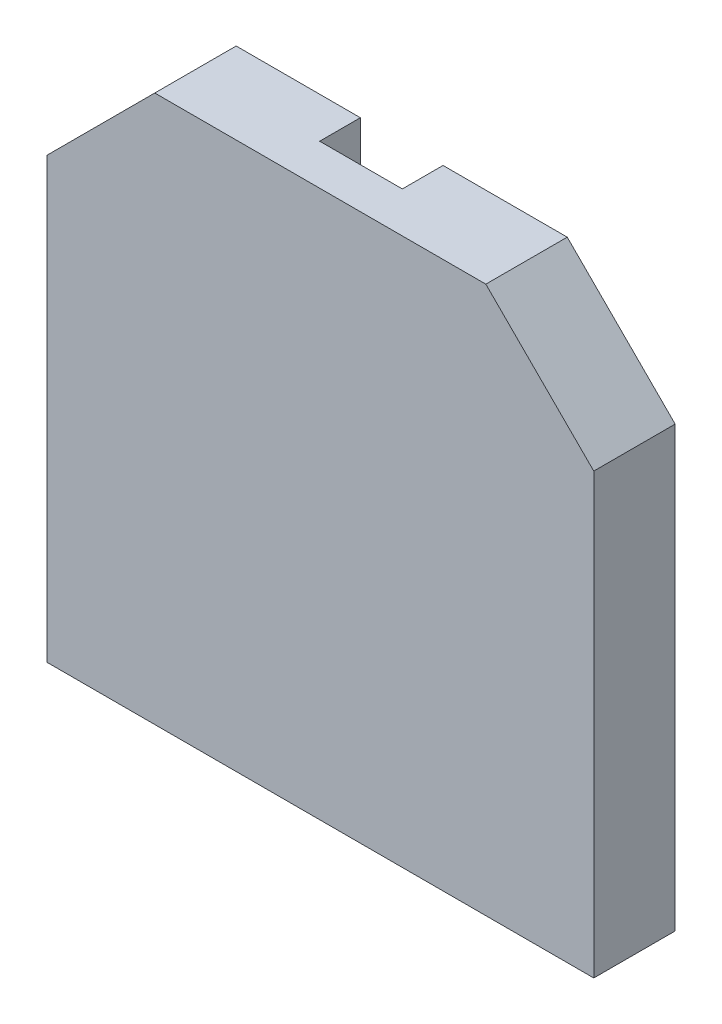
ISO-10303-21;
HEADER;
FILE_DESCRIPTION(('STEP AP214'),'2;1');
FILE_NAME('part.step','',(''),(''),'','','');
FILE_SCHEMA(('AUTOMOTIVE_DESIGN { 1 0 10303 214 1 1 1 1 }'));
ENDSEC;
DATA;
#1=APPLICATION_CONTEXT('core data for automotive mechanical design processes');
#2=APPLICATION_PROTOCOL_DEFINITION('international standard','automotive_design',2000,#1);
#3=PRODUCT_CONTEXT('',#1,'mechanical');
#4=PRODUCT('Part','Part','',(#3));
#5=PRODUCT_RELATED_PRODUCT_CATEGORY('part','',(#4));
#6=PRODUCT_DEFINITION_FORMATION('','',#4);
#7=PRODUCT_DEFINITION_CONTEXT('part definition',#1,'design');
#8=PRODUCT_DEFINITION('design','',#6,#7);
#9=PRODUCT_DEFINITION_SHAPE('','',#8);
#10=(LENGTH_UNIT() NAMED_UNIT(*) SI_UNIT(.MILLI.,.METRE.));
#11=(NAMED_UNIT(*) PLANE_ANGLE_UNIT() SI_UNIT($,.RADIAN.));
#12=(NAMED_UNIT(*) SI_UNIT($,.STERADIAN.) SOLID_ANGLE_UNIT());
#13=UNCERTAINTY_MEASURE_WITH_UNIT(LENGTH_MEASURE(1.E-05),#10,'distance_accuracy_value','');
#14=(GEOMETRIC_REPRESENTATION_CONTEXT(3) GLOBAL_UNCERTAINTY_ASSIGNED_CONTEXT((#13)) GLOBAL_UNIT_ASSIGNED_CONTEXT((#10,
#11,#12)) REPRESENTATION_CONTEXT('',''));
#15=CARTESIAN_POINT('',(0.,0.,0.));
#16=DIRECTION('',(0.,0.,1.));
#17=DIRECTION('',(1.,0.,0.));
#18=AXIS2_PLACEMENT_3D('',#15,#16,#17);
#19=CARTESIAN_POINT('',(-0.32500062,-2.34697524,0.31999936));
#20=DIRECTION('',(0.,0.,-1.));
#21=DIRECTION('',(-1.,0.,0.));
#22=AXIS2_PLACEMENT_3D('',#19,#20,#21);
#23=PLANE('',#22);
#24=DIRECTION('',(0.,1.,0.));
#25=VECTOR('',#24,1.);
#26=CARTESIAN_POINT('',(0.32500062,-4.14280096,0.31999936));
#27=LINE('',#26,#25);
#28=CARTESIAN_POINT('',(0.32500062,-3.9928038,0.31999936));
#29=VERTEX_POINT('',#28);
#30=CARTESIAN_POINT('',(0.32500062,-2.34697524,0.31999936));
#31=VERTEX_POINT('',#30);
#32=EDGE_CURVE('E115',#29,#31,#27,.T.);
#33=ORIENTED_EDGE('',*,*,#32,.F.);
#34=DIRECTION('',(-1.,0.,0.));
#35=VECTOR('',#34,1.);
#36=CARTESIAN_POINT('',(-0.32500062,-3.9928038,0.31999936));
#37=LINE('',#36,#35);
#38=CARTESIAN_POINT('',(-0.32500062,-3.9928038,0.31999936));
#39=VERTEX_POINT('',#38);
#40=EDGE_CURVE('E19',#29,#39,#37,.T.);
#41=ORIENTED_EDGE('',*,*,#40,.T.);
#42=DIRECTION('',(0.,1.,0.));
#43=VECTOR('',#42,1.);
#44=CARTESIAN_POINT('',(-0.32500062,-2.34697524,0.31999936));
#45=LINE('',#44,#43);
#46=CARTESIAN_POINT('',(-0.32500062,-2.34697524,0.31999936));
#47=VERTEX_POINT('',#46);
#48=EDGE_CURVE('E142',#47,#39,#45,.F.);
#49=ORIENTED_EDGE('',*,*,#48,.F.);
#50=DIRECTION('',(1.,0.,0.));
#51=VECTOR('',#50,1.);
#52=CARTESIAN_POINT('',(0.32500062,-2.34697524,0.31999936));
#53=LINE('',#52,#51);
#54=EDGE_CURVE('E131',#31,#47,#53,.F.);
#55=ORIENTED_EDGE('',*,*,#54,.F.);
#56=EDGE_LOOP('',(#33,#41,#49,#55));
#57=FACE_BOUND('',#56,.T.);
#58=ADVANCED_FACE('F16',(#57),#23,.T.);
#59=CARTESIAN_POINT('',(-0.32500062,0.45719746,0.31999936));
#60=DIRECTION('',(0.,0.,-1.));
#61=DIRECTION('',(-1.,0.,0.));
#62=AXIS2_PLACEMENT_3D('',#59,#60,#61);
#63=PLANE('',#62);
#64=DIRECTION('',(0.,1.,0.));
#65=VECTOR('',#64,1.);
#66=CARTESIAN_POINT('',(-0.32500062,0.45719746,0.31999936));
#67=LINE('',#66,#65);
#68=CARTESIAN_POINT('',(-0.32500062,0.30719776,0.31999936));
#69=VERTEX_POINT('',#68);
#70=CARTESIAN_POINT('',(-0.32500062,-1.33862826,0.31999936));
#71=VERTEX_POINT('',#70);
#72=EDGE_CURVE('E145',#69,#71,#67,.F.);
#73=ORIENTED_EDGE('',*,*,#72,.F.);
#74=DIRECTION('',(-1.,0.,0.));
#75=VECTOR('',#74,1.);
#76=CARTESIAN_POINT('',(-0.32500062,0.30719776,0.31999936));
#77=LINE('',#76,#75);
#78=CARTESIAN_POINT('',(0.32500062,0.30719776,0.31999936));
#79=VERTEX_POINT('',#78);
#80=EDGE_CURVE('E127',#69,#79,#77,.F.);
#81=ORIENTED_EDGE('',*,*,#80,.T.);
#82=DIRECTION('',(0.,1.,0.));
#83=VECTOR('',#82,1.);
#84=CARTESIAN_POINT('',(0.32500062,-1.33862826,0.31999936));
#85=LINE('',#84,#83);
#86=CARTESIAN_POINT('',(0.32500062,-1.33862826,0.31999936));
#87=VERTEX_POINT('',#86);
#88=EDGE_CURVE('E158',#87,#79,#85,.T.);
#89=ORIENTED_EDGE('',*,*,#88,.F.);
#90=DIRECTION('',(1.,0.,0.));
#91=VECTOR('',#90,1.);
#92=CARTESIAN_POINT('',(-0.32500062,-1.33862826,0.31999936));
#93=LINE('',#92,#91);
#94=EDGE_CURVE('E150',#71,#87,#93,.T.);
#95=ORIENTED_EDGE('',*,*,#94,.F.);
#96=EDGE_LOOP('',(#73,#81,#89,#95));
#97=FACE_BOUND('',#96,.T.);
#98=ADVANCED_FACE('F264',(#97),#63,.T.);
#99=CARTESIAN_POINT('',(0.32500062,-4.14280096,-1.00000054));
#100=DIRECTION('',(-1.,0.,0.));
#101=DIRECTION('',(0.,0.,1.));
#102=AXIS2_PLACEMENT_3D('',#99,#100,#101);
#103=PLANE('',#102);
#104=DIRECTION('',(0.,1.,0.));
#105=VECTOR('',#104,1.);
#106=CARTESIAN_POINT('',(0.32500062,-0.54133242,0.));
#107=LINE('',#106,#105);
#108=CARTESIAN_POINT('',(0.32500062,-3.9928038,0.));
#109=VERTEX_POINT('',#108);
#110=CARTESIAN_POINT('',(0.32500062,-2.34697524,0.));
#111=VERTEX_POINT('',#110);
#112=EDGE_CURVE('E129',#109,#111,#107,.T.);
#113=ORIENTED_EDGE('',*,*,#112,.F.);
#114=DIRECTION('',(0.,0.,1.));
#115=VECTOR('',#114,1.);
#116=CARTESIAN_POINT('',(0.32500062,-3.9928038,-1.00000054));
#117=LINE('',#116,#115);
#118=EDGE_CURVE('E120',#109,#29,#117,.T.);
#119=ORIENTED_EDGE('',*,*,#118,.T.);
#120=ORIENTED_EDGE('',*,*,#32,.T.);
#121=DIRECTION('',(0.,0.,-1.));
#122=VECTOR('',#121,1.);
#123=CARTESIAN_POINT('',(0.32500062,-2.34697524,-1.00000054));
#124=LINE('',#123,#122);
#125=EDGE_CURVE('E137',#111,#31,#124,.F.);
#126=ORIENTED_EDGE('',*,*,#125,.F.);
#127=EDGE_LOOP('',(#113,#119,#120,#126));
#128=FACE_BOUND('',#127,.T.);
#129=ADVANCED_FACE('F128',(#128),#103,.T.);
#130=CARTESIAN_POINT('',(0.32500062,-2.34697524,-1.00000054));
#131=DIRECTION('',(0.,-1.,0.));
#132=DIRECTION('',(0.,0.,-1.));
#133=AXIS2_PLACEMENT_3D('',#130,#131,#132);
#134=PLANE('',#133);
#135=DIRECTION('',(-1.,0.,0.));
#136=VECTOR('',#135,1.);
#137=CARTESIAN_POINT('',(-2.15000078,-2.34697524,0.));
#138=LINE('',#137,#136);
#139=CARTESIAN_POINT('',(-0.32500062,-2.34697524,0.));
#140=VERTEX_POINT('',#139);
#141=EDGE_CURVE('E164',#111,#140,#138,.T.);
#142=ORIENTED_EDGE('',*,*,#141,.F.);
#143=ORIENTED_EDGE('',*,*,#125,.T.);
#144=ORIENTED_EDGE('',*,*,#54,.T.);
#145=DIRECTION('',(0.,0.,-1.));
#146=VECTOR('',#145,1.);
#147=CARTESIAN_POINT('',(-0.32500062,-2.34697524,-1.00000054));
#148=LINE('',#147,#146);
#149=EDGE_CURVE('E139',#140,#47,#148,.F.);
#150=ORIENTED_EDGE('',*,*,#149,.F.);
#151=EDGE_LOOP('',(#142,#143,#144,#150));
#152=FACE_BOUND('',#151,.T.);
#153=ADVANCED_FACE('F254',(#152),#134,.T.);
#154=CARTESIAN_POINT('',(-0.32500062,-2.34697524,-1.00000054));
#155=DIRECTION('',(1.,0.,0.));
#156=DIRECTION('',(0.,0.,-1.));
#157=AXIS2_PLACEMENT_3D('',#154,#155,#156);
#158=PLANE('',#157);
#159=ORIENTED_EDGE('',*,*,#48,.T.);
#160=DIRECTION('',(0.,0.,-1.));
#161=VECTOR('',#160,1.);
#162=CARTESIAN_POINT('',(-0.32500062,-3.9928038,-1.00000054));
#163=LINE('',#162,#161);
#164=CARTESIAN_POINT('',(-0.32500062,-3.9928038,0.));
#165=VERTEX_POINT('',#164);
#166=EDGE_CURVE('E123',#39,#165,#163,.T.);
#167=ORIENTED_EDGE('',*,*,#166,.T.);
#168=DIRECTION('',(0.,1.,0.));
#169=VECTOR('',#168,1.);
#170=CARTESIAN_POINT('',(-0.32500062,-0.54133242,0.));
#171=LINE('',#170,#169);
#172=EDGE_CURVE('E166',#140,#165,#171,.F.);
#173=ORIENTED_EDGE('',*,*,#172,.F.);
#174=ORIENTED_EDGE('',*,*,#149,.T.);
#175=EDGE_LOOP('',(#159,#167,#173,#174));
#176=FACE_BOUND('',#175,.T.);
#177=ADVANCED_FACE('F252',(#176),#158,.T.);
#178=CARTESIAN_POINT('',(-0.32500062,0.45719746,-1.00000054));
#179=DIRECTION('',(1.,0.,0.));
#180=DIRECTION('',(0.,0.,-1.));
#181=AXIS2_PLACEMENT_3D('',#178,#179,#180);
#182=PLANE('',#181);
#183=DIRECTION('',(0.,1.,0.));
#184=VECTOR('',#183,1.);
#185=CARTESIAN_POINT('',(-0.32500062,-0.54133242,0.));
#186=LINE('',#185,#184);
#187=CARTESIAN_POINT('',(-0.32500062,0.30719776,0.));
#188=VERTEX_POINT('',#187);
#189=CARTESIAN_POINT('',(-0.32500062,-1.33862826,0.));
#190=VERTEX_POINT('',#189);
#191=EDGE_CURVE('E169',#188,#190,#186,.F.);
#192=ORIENTED_EDGE('',*,*,#191,.F.);
#193=DIRECTION('',(0.,0.,-1.));
#194=VECTOR('',#193,1.);
#195=CARTESIAN_POINT('',(-0.32500062,0.30719776,-1.00000054));
#196=LINE('',#195,#194);
#197=EDGE_CURVE('E147',#188,#69,#196,.F.);
#198=ORIENTED_EDGE('',*,*,#197,.T.);
#199=ORIENTED_EDGE('',*,*,#72,.T.);
#200=DIRECTION('',(0.,0.,1.));
#201=VECTOR('',#200,1.);
#202=CARTESIAN_POINT('',(-0.32500062,-1.33862826,-1.00000054));
#203=LINE('',#202,#201);
#204=EDGE_CURVE('E152',#190,#71,#203,.T.);
#205=ORIENTED_EDGE('',*,*,#204,.F.);
#206=EDGE_LOOP('',(#192,#198,#199,#205));
#207=FACE_BOUND('',#206,.T.);
#208=ADVANCED_FACE('F262',(#207),#182,.T.);
#209=CARTESIAN_POINT('',(-0.32500062,-1.33862826,-1.00000054));
#210=DIRECTION('',(0.,1.,0.));
#211=DIRECTION('',(0.,0.,1.));
#212=AXIS2_PLACEMENT_3D('',#209,#210,#211);
#213=PLANE('',#212);
#214=DIRECTION('',(-1.,0.,0.));
#215=VECTOR('',#214,1.);
#216=CARTESIAN_POINT('',(-2.15000078,-1.33862826,0.));
#217=LINE('',#216,#215);
#218=CARTESIAN_POINT('',(0.32500062,-1.33862826,0.));
#219=VERTEX_POINT('',#218);
#220=EDGE_CURVE('E171',#190,#219,#217,.F.);
#221=ORIENTED_EDGE('',*,*,#220,.F.);
#222=ORIENTED_EDGE('',*,*,#204,.T.);
#223=ORIENTED_EDGE('',*,*,#94,.T.);
#224=DIRECTION('',(0.,0.,1.));
#225=VECTOR('',#224,1.);
#226=CARTESIAN_POINT('',(0.32500062,-1.33862826,-1.00000054));
#227=LINE('',#226,#225);
#228=EDGE_CURVE('E155',#219,#87,#227,.T.);
#229=ORIENTED_EDGE('',*,*,#228,.F.);
#230=EDGE_LOOP('',(#221,#222,#223,#229));
#231=FACE_BOUND('',#230,.T.);
#232=ADVANCED_FACE('F288',(#231),#213,.T.);
#233=CARTESIAN_POINT('',(0.32500062,-1.33862826,-1.00000054));
#234=DIRECTION('',(-1.,0.,0.));
#235=DIRECTION('',(0.,0.,1.));
#236=AXIS2_PLACEMENT_3D('',#233,#234,#235);
#237=PLANE('',#236);
#238=ORIENTED_EDGE('',*,*,#88,.T.);
#239=DIRECTION('',(0.,0.,1.));
#240=VECTOR('',#239,1.);
#241=CARTESIAN_POINT('',(0.32500062,0.30719776,-1.00000054));
#242=LINE('',#241,#240);
#243=CARTESIAN_POINT('',(0.32500062,0.30719776,0.));
#244=VERTEX_POINT('',#243);
#245=EDGE_CURVE('E161',#79,#244,#242,.F.);
#246=ORIENTED_EDGE('',*,*,#245,.T.);
#247=DIRECTION('',(0.,1.,0.));
#248=VECTOR('',#247,1.);
#249=CARTESIAN_POINT('',(0.32500062,-0.54133242,0.));
#250=LINE('',#249,#248);
#251=EDGE_CURVE('E173',#219,#244,#250,.T.);
#252=ORIENTED_EDGE('',*,*,#251,.F.);
#253=ORIENTED_EDGE('',*,*,#228,.T.);
#254=EDGE_LOOP('',(#238,#246,#252,#253));
#255=FACE_BOUND('',#254,.T.);
#256=ADVANCED_FACE('F285',(#255),#237,.T.);
#257=CARTESIAN_POINT('',(-2.15000078,-0.54133242,0.));
#258=DIRECTION('',(0.,0.,-1.));
#259=DIRECTION('',(-1.,0.,0.));
#260=AXIS2_PLACEMENT_3D('',#257,#258,#259);
#261=PLANE('',#260);
#262=DIRECTION('',(0.707106781186548,-0.707106781186548,0.));
#263=VECTOR('',#262,1.);
#264=CARTESIAN_POINT('',(2.15000078,-0.54133242,0.));
#265=LINE('',#264,#263);
#266=CARTESIAN_POINT('',(1.3014706,0.30719776,0.));
#267=VERTEX_POINT('',#266);
#268=CARTESIAN_POINT('',(2.15000078,-0.54133242,0.));
#269=VERTEX_POINT('',#268);
#270=EDGE_CURVE('E193',#267,#269,#265,.T.);
#271=ORIENTED_EDGE('',*,*,#270,.T.);
#272=DIRECTION('',(0.,1.,0.));
#273=VECTOR('',#272,1.);
#274=CARTESIAN_POINT('',(2.15000078,-3.9928038,0.));
#275=LINE('',#274,#273);
#276=CARTESIAN_POINT('',(2.15000078,-3.9928038,0.));
#277=VERTEX_POINT('',#276);
#278=EDGE_CURVE('E199',#269,#277,#275,.F.);
#279=ORIENTED_EDGE('',*,*,#278,.T.);
#280=DIRECTION('',(1.,0.,0.));
#281=VECTOR('',#280,1.);
#282=CARTESIAN_POINT('',(-2.15000078,-3.9928038,0.));
#283=LINE('',#282,#281);
#284=EDGE_CURVE('E211',#277,#109,#283,.F.);
#285=ORIENTED_EDGE('',*,*,#284,.T.);
#286=ORIENTED_EDGE('',*,*,#112,.T.);
#287=ORIENTED_EDGE('',*,*,#141,.T.);
#288=ORIENTED_EDGE('',*,*,#172,.T.);
#289=DIRECTION('',(1.,0.,0.));
#290=VECTOR('',#289,1.);
#291=CARTESIAN_POINT('',(-2.15000078,-3.9928038,0.));
#292=LINE('',#291,#290);
#293=CARTESIAN_POINT('',(-2.15000078,-3.9928038,0.));
#294=VERTEX_POINT('',#293);
#295=EDGE_CURVE('E204',#165,#294,#292,.F.);
#296=ORIENTED_EDGE('',*,*,#295,.T.);
#297=DIRECTION('',(0.,1.,0.));
#298=VECTOR('',#297,1.);
#299=CARTESIAN_POINT('',(-2.15000078,-0.54133242,0.));
#300=LINE('',#299,#298);
#301=CARTESIAN_POINT('',(-2.15000078,-0.54133242,0.));
#302=VERTEX_POINT('',#301);
#303=EDGE_CURVE('E176',#294,#302,#300,.T.);
#304=ORIENTED_EDGE('',*,*,#303,.T.);
#305=DIRECTION('',(0.707106781186548,0.707106781186548,0.));
#306=VECTOR('',#305,1.);
#307=CARTESIAN_POINT('',(-1.3014706,0.30719776,0.));
#308=LINE('',#307,#306);
#309=CARTESIAN_POINT('',(-1.3014706,0.30719776,0.));
#310=VERTEX_POINT('',#309);
#311=EDGE_CURVE('E179',#302,#310,#308,.T.);
#312=ORIENTED_EDGE('',*,*,#311,.T.);
#313=DIRECTION('',(1.,0.,0.));
#314=VECTOR('',#313,1.);
#315=CARTESIAN_POINT('',(1.3014706,0.30719776,0.));
#316=LINE('',#315,#314);
#317=EDGE_CURVE('E187',#310,#188,#316,.T.);
#318=ORIENTED_EDGE('',*,*,#317,.T.);
#319=ORIENTED_EDGE('',*,*,#191,.T.);
#320=ORIENTED_EDGE('',*,*,#220,.T.);
#321=ORIENTED_EDGE('',*,*,#251,.T.);
#322=DIRECTION('',(1.,0.,0.));
#323=VECTOR('',#322,1.);
#324=CARTESIAN_POINT('',(1.3014706,0.30719776,0.));
#325=LINE('',#324,#323);
#326=EDGE_CURVE('E190',#244,#267,#325,.T.);
#327=ORIENTED_EDGE('',*,*,#326,.T.);
#328=EDGE_LOOP('',(#271,#279,#285,#286,#287,#288,#296,#304,#312,#318,#319,#320,#321,#327));
#329=FACE_BOUND('',#328,.T.);
#330=ADVANCED_FACE('F247',(#329),#261,.T.);
#331=CARTESIAN_POINT('',(-2.15000078,-0.54133242,0.));
#332=DIRECTION('',(1.,0.,0.));
#333=DIRECTION('',(0.,0.,-1.));
#334=AXIS2_PLACEMENT_3D('',#331,#332,#333);
#335=PLANE('',#334);
#336=DIRECTION('',(0.,1.,0.));
#337=VECTOR('',#336,1.);
#338=CARTESIAN_POINT('',(-2.15000078,-0.54133242,0.64000126));
#339=LINE('',#338,#337);
#340=CARTESIAN_POINT('',(-2.15000078,-3.9928038,0.64000126));
#341=VERTEX_POINT('',#340);
#342=CARTESIAN_POINT('',(-2.15000078,-0.54133242,0.64000126));
#343=VERTEX_POINT('',#342);
#344=EDGE_CURVE('E213',#341,#343,#339,.T.);
#345=ORIENTED_EDGE('',*,*,#344,.T.);
#346=DIRECTION('',(0.,0.,1.));
#347=VECTOR('',#346,1.);
#348=CARTESIAN_POINT('',(-2.15000078,-0.54133242,0.));
#349=LINE('',#348,#347);
#350=EDGE_CURVE('E181',#343,#302,#349,.F.);
#351=ORIENTED_EDGE('',*,*,#350,.T.);
#352=ORIENTED_EDGE('',*,*,#303,.F.);
#353=DIRECTION('',(0.,0.,1.));
#354=VECTOR('',#353,1.);
#355=CARTESIAN_POINT('',(-2.15000078,-3.9928038,0.));
#356=LINE('',#355,#354);
#357=EDGE_CURVE('E207',#294,#341,#356,.T.);
#358=ORIENTED_EDGE('',*,*,#357,.T.);
#359=EDGE_LOOP('',(#345,#351,#352,#358));
#360=FACE_BOUND('',#359,.T.);
#361=ADVANCED_FACE('F244',(#360),#335,.F.);
#362=CARTESIAN_POINT('',(-1.3014706,0.30719776,0.));
#363=DIRECTION('',(0.707106781186548,-0.707106781186548,0.));
#364=DIRECTION('',(0.707106781186548,0.707106781186548,0.));
#365=AXIS2_PLACEMENT_3D('',#362,#363,#364);
#366=PLANE('',#365);
#367=DIRECTION('',(0.707106781186547,0.707106781186548,0.));
#368=VECTOR('',#367,1.);
#369=CARTESIAN_POINT('',(-2.15000078,-0.54133242,0.64000126));
#370=LINE('',#369,#368);
#371=CARTESIAN_POINT('',(-1.3014706,0.30719776,0.64000126));
#372=VERTEX_POINT('',#371);
#373=EDGE_CURVE('E216',#343,#372,#370,.T.);
#374=ORIENTED_EDGE('',*,*,#373,.T.);
#375=DIRECTION('',(0.,0.,-1.));
#376=VECTOR('',#375,1.);
#377=CARTESIAN_POINT('',(-1.3014706,0.30719776,0.));
#378=LINE('',#377,#376);
#379=EDGE_CURVE('E184',#372,#310,#378,.T.);
#380=ORIENTED_EDGE('',*,*,#379,.T.);
#381=ORIENTED_EDGE('',*,*,#311,.F.);
#382=ORIENTED_EDGE('',*,*,#350,.F.);
#383=EDGE_LOOP('',(#374,#380,#381,#382));
#384=FACE_BOUND('',#383,.T.);
#385=ADVANCED_FACE('F242',(#384),#366,.F.);
#386=CARTESIAN_POINT('',(1.3014706,0.30719776,0.));
#387=DIRECTION('',(0.,-1.,0.));
#388=DIRECTION('',(0.,0.,-1.));
#389=AXIS2_PLACEMENT_3D('',#386,#387,#388);
#390=PLANE('',#389);
#391=DIRECTION('',(0.,0.,1.));
#392=VECTOR('',#391,1.);
#393=CARTESIAN_POINT('',(1.3014706,0.30719776,0.));
#394=LINE('',#393,#392);
#395=CARTESIAN_POINT('',(1.3014706,0.30719776,0.64000126));
#396=VERTEX_POINT('',#395);
#397=EDGE_CURVE('E196',#396,#267,#394,.F.);
#398=ORIENTED_EDGE('',*,*,#397,.T.);
#399=ORIENTED_EDGE('',*,*,#326,.F.);
#400=ORIENTED_EDGE('',*,*,#245,.F.);
#401=ORIENTED_EDGE('',*,*,#80,.F.);
#402=ORIENTED_EDGE('',*,*,#197,.F.);
#403=ORIENTED_EDGE('',*,*,#317,.F.);
#404=ORIENTED_EDGE('',*,*,#379,.F.);
#405=DIRECTION('',(-1.,0.,0.));
#406=VECTOR('',#405,1.);
#407=CARTESIAN_POINT('',(-2.15000078,0.30719776,0.64000126));
#408=LINE('',#407,#406);
#409=EDGE_CURVE('E219',#372,#396,#408,.F.);
#410=ORIENTED_EDGE('',*,*,#409,.T.);
#411=EDGE_LOOP('',(#398,#399,#400,#401,#402,#403,#404,#410));
#412=FACE_BOUND('',#411,.T.);
#413=ADVANCED_FACE('F237',(#412),#390,.F.);
#414=CARTESIAN_POINT('',(2.15000078,-0.54133242,0.));
#415=DIRECTION('',(-0.707106781186548,-0.707106781186548,0.));
#416=DIRECTION('',(0.707106781186548,-0.707106781186548,0.));
#417=AXIS2_PLACEMENT_3D('',#414,#415,#416);
#418=PLANE('',#417);
#419=DIRECTION('',(0.707106781186547,-0.707106781186548,0.));
#420=VECTOR('',#419,1.);
#421=CARTESIAN_POINT('',(1.3014706,0.30719776,0.64000126));
#422=LINE('',#421,#420);
#423=CARTESIAN_POINT('',(2.15000078,-0.54133242,0.64000126));
#424=VERTEX_POINT('',#423);
#425=EDGE_CURVE('E222',#396,#424,#422,.T.);
#426=ORIENTED_EDGE('',*,*,#425,.T.);
#427=DIRECTION('',(0.,0.,1.));
#428=VECTOR('',#427,1.);
#429=CARTESIAN_POINT('',(2.15000078,-0.54133242,0.));
#430=LINE('',#429,#428);
#431=EDGE_CURVE('E201',#424,#269,#430,.F.);
#432=ORIENTED_EDGE('',*,*,#431,.T.);
#433=ORIENTED_EDGE('',*,*,#270,.F.);
#434=ORIENTED_EDGE('',*,*,#397,.F.);
#435=EDGE_LOOP('',(#426,#432,#433,#434));
#436=FACE_BOUND('',#435,.T.);
#437=ADVANCED_FACE('F234',(#436),#418,.F.);
#438=CARTESIAN_POINT('',(2.15000078,-3.9928038,0.));
#439=DIRECTION('',(-1.,0.,0.));
#440=DIRECTION('',(0.,0.,1.));
#441=AXIS2_PLACEMENT_3D('',#438,#439,#440);
#442=PLANE('',#441);
#443=DIRECTION('',(0.,1.,0.));
#444=VECTOR('',#443,1.);
#445=CARTESIAN_POINT('',(2.15000078,-0.54133242,0.64000126));
#446=LINE('',#445,#444);
#447=CARTESIAN_POINT('',(2.15000078,-3.9928038,0.64000126));
#448=VERTEX_POINT('',#447);
#449=EDGE_CURVE('E25',#424,#448,#446,.F.);
#450=ORIENTED_EDGE('',*,*,#449,.T.);
#451=DIRECTION('',(0.,0.,1.));
#452=VECTOR('',#451,1.);
#453=CARTESIAN_POINT('',(2.15000078,-3.9928038,0.));
#454=LINE('',#453,#452);
#455=EDGE_CURVE('E33',#448,#277,#454,.F.);
#456=ORIENTED_EDGE('',*,*,#455,.T.);
#457=ORIENTED_EDGE('',*,*,#278,.F.);
#458=ORIENTED_EDGE('',*,*,#431,.F.);
#459=EDGE_LOOP('',(#450,#456,#457,#458));
#460=FACE_BOUND('',#459,.T.);
#461=ADVANCED_FACE('F228',(#460),#442,.F.);
#462=CARTESIAN_POINT('',(-2.15000078,-3.9928038,0.));
#463=DIRECTION('',(0.,1.,0.));
#464=DIRECTION('',(0.,0.,1.));
#465=AXIS2_PLACEMENT_3D('',#462,#463,#464);
#466=PLANE('',#465);
#467=ORIENTED_EDGE('',*,*,#455,.F.);
#468=DIRECTION('',(-1.,0.,0.));
#469=VECTOR('',#468,1.);
#470=CARTESIAN_POINT('',(-2.15000078,-3.9928038,0.64000126));
#471=LINE('',#470,#469);
#472=EDGE_CURVE('E11',#448,#341,#471,.T.);
#473=ORIENTED_EDGE('',*,*,#472,.T.);
#474=ORIENTED_EDGE('',*,*,#357,.F.);
#475=ORIENTED_EDGE('',*,*,#295,.F.);
#476=ORIENTED_EDGE('',*,*,#166,.F.);
#477=ORIENTED_EDGE('',*,*,#40,.F.);
#478=ORIENTED_EDGE('',*,*,#118,.F.);
#479=ORIENTED_EDGE('',*,*,#284,.F.);
#480=EDGE_LOOP('',(#467,#473,#474,#475,#476,#477,#478,#479));
#481=FACE_BOUND('',#480,.T.);
#482=ADVANCED_FACE('F119',(#481),#466,.F.);
#483=CARTESIAN_POINT('',(-2.15000078,-0.54133242,0.64000126));
#484=DIRECTION('',(0.,0.,-1.));
#485=DIRECTION('',(-1.,0.,0.));
#486=AXIS2_PLACEMENT_3D('',#483,#484,#485);
#487=PLANE('',#486);
#488=ORIENTED_EDGE('',*,*,#449,.F.);
#489=ORIENTED_EDGE('',*,*,#425,.F.);
#490=ORIENTED_EDGE('',*,*,#409,.F.);
#491=ORIENTED_EDGE('',*,*,#373,.F.);
#492=ORIENTED_EDGE('',*,*,#344,.F.);
#493=ORIENTED_EDGE('',*,*,#472,.F.);
#494=EDGE_LOOP('',(#488,#489,#490,#491,#492,#493));
#495=FACE_BOUND('',#494,.T.);
#496=ADVANCED_FACE('F231',(#495),#487,.F.);
#497=CLOSED_SHELL('',(#58,#98,#129,#153,#177,#208,#232,#256,#330,#361,#385,#413,#437,#461,#482,#496));
#498=MANIFOLD_SOLID_BREP('B1',#497);
#499=ADVANCED_BREP_SHAPE_REPRESENTATION('',(#18,#498),#14);
#500=SHAPE_DEFINITION_REPRESENTATION(#9,#499);
ENDSEC;
END-ISO-10303-21;
